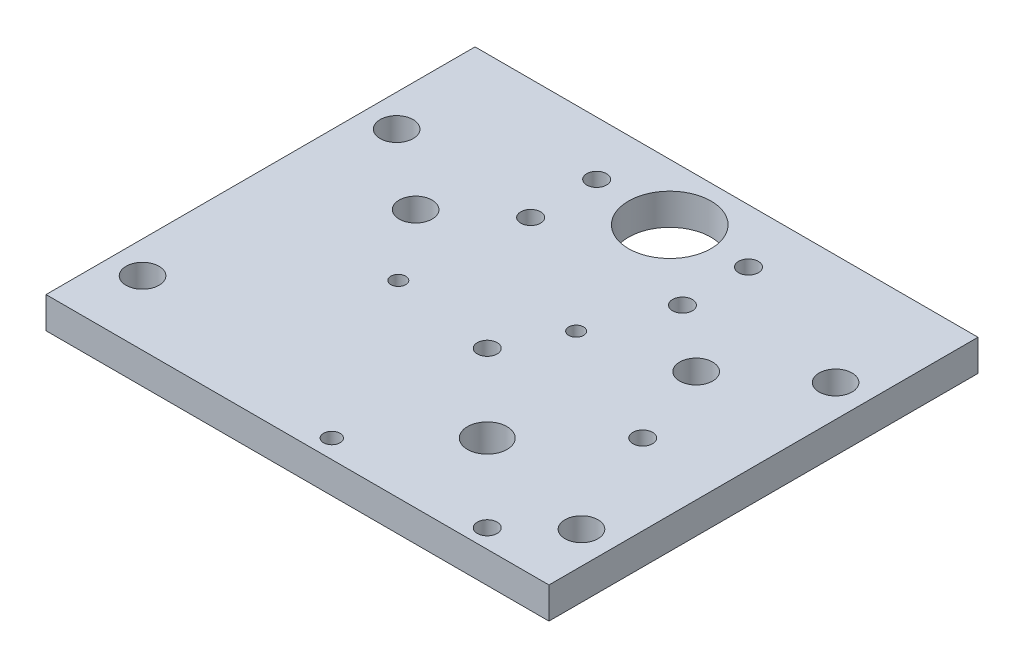
ISO-10303-21;
HEADER;
FILE_DESCRIPTION(('STEP AP214'),'2;1');
FILE_NAME('part.step','',(''),(''),'','','');
FILE_SCHEMA(('AUTOMOTIVE_DESIGN { 1 0 10303 214 1 1 1 1 }'));
ENDSEC;
DATA;
#1=APPLICATION_CONTEXT('core data for automotive mechanical design processes');
#2=APPLICATION_PROTOCOL_DEFINITION('international standard','automotive_design',2000,#1);
#3=PRODUCT_CONTEXT('',#1,'mechanical');
#4=PRODUCT('Part','Part','',(#3));
#5=PRODUCT_RELATED_PRODUCT_CATEGORY('part','',(#4));
#6=PRODUCT_DEFINITION_FORMATION('','',#4);
#7=PRODUCT_DEFINITION_CONTEXT('part definition',#1,'design');
#8=PRODUCT_DEFINITION('design','',#6,#7);
#9=PRODUCT_DEFINITION_SHAPE('','',#8);
#10=(LENGTH_UNIT() NAMED_UNIT(*) SI_UNIT(.MILLI.,.METRE.));
#11=(NAMED_UNIT(*) PLANE_ANGLE_UNIT() SI_UNIT($,.RADIAN.));
#12=(NAMED_UNIT(*) SI_UNIT($,.STERADIAN.) SOLID_ANGLE_UNIT());
#13=UNCERTAINTY_MEASURE_WITH_UNIT(LENGTH_MEASURE(1.E-05),#10,'distance_accuracy_value','');
#14=(GEOMETRIC_REPRESENTATION_CONTEXT(3) GLOBAL_UNCERTAINTY_ASSIGNED_CONTEXT((#13)) GLOBAL_UNIT_ASSIGNED_CONTEXT((#10,
#11,#12)) REPRESENTATION_CONTEXT('',''));
#15=CARTESIAN_POINT('',(0.,0.,0.));
#16=DIRECTION('',(0.,0.,1.));
#17=DIRECTION('',(1.,0.,0.));
#18=AXIS2_PLACEMENT_3D('',#15,#16,#17);
#19=CARTESIAN_POINT('',(76.2,9.5,65.));
#20=DIRECTION('',(-1.,0.,0.));
#21=DIRECTION('',(0.,0.,1.));
#22=AXIS2_PLACEMENT_3D('',#19,#20,#21);
#23=PLANE('',#22);
#24=DIRECTION('',(0.,0.,-1.));
#25=VECTOR('',#24,1.);
#26=CARTESIAN_POINT('',(76.2,0.,65.));
#27=LINE('',#26,#25);
#28=CARTESIAN_POINT('',(76.2,0.,65.));
#29=VERTEX_POINT('',#28);
#30=CARTESIAN_POINT('',(76.2,0.,-65.));
#31=VERTEX_POINT('',#30);
#32=EDGE_CURVE('E99',#29,#31,#27,.T.);
#33=ORIENTED_EDGE('',*,*,#32,.T.);
#34=DIRECTION('',(0.,-1.,0.));
#35=VECTOR('',#34,1.);
#36=CARTESIAN_POINT('',(76.2,9.5,-65.));
#37=LINE('',#36,#35);
#38=CARTESIAN_POINT('',(76.2,9.5,-65.));
#39=VERTEX_POINT('',#38);
#40=EDGE_CURVE('E11',#39,#31,#37,.T.);
#41=ORIENTED_EDGE('',*,*,#40,.F.);
#42=DIRECTION('',(0.,0.,-1.));
#43=VECTOR('',#42,1.);
#44=CARTESIAN_POINT('',(76.2,9.5,65.));
#45=LINE('',#44,#43);
#46=CARTESIAN_POINT('',(76.2,9.5,65.));
#47=VERTEX_POINT('',#46);
#48=EDGE_CURVE('E86',#47,#39,#45,.T.);
#49=ORIENTED_EDGE('',*,*,#48,.F.);
#50=DIRECTION('',(0.,-1.,0.));
#51=VECTOR('',#50,1.);
#52=CARTESIAN_POINT('',(76.2,9.5,65.));
#53=LINE('',#52,#51);
#54=EDGE_CURVE('E95',#47,#29,#53,.T.);
#55=ORIENTED_EDGE('',*,*,#54,.T.);
#56=EDGE_LOOP('',(#33,#41,#49,#55));
#57=FACE_BOUND('',#56,.T.);
#58=ADVANCED_FACE('F34',(#57),#23,.F.);
#59=CARTESIAN_POINT('',(-76.2,9.5,-65.));
#60=DIRECTION('',(0.,0.,1.));
#61=DIRECTION('',(1.,0.,0.));
#62=AXIS2_PLACEMENT_3D('',#59,#60,#61);
#63=PLANE('',#62);
#64=DIRECTION('',(-1.,0.,0.));
#65=VECTOR('',#64,1.);
#66=CARTESIAN_POINT('',(-76.2,0.,-65.));
#67=LINE('',#66,#65);
#68=CARTESIAN_POINT('',(-76.2,0.,-65.));
#69=VERTEX_POINT('',#68);
#70=EDGE_CURVE('E90',#31,#69,#67,.T.);
#71=ORIENTED_EDGE('',*,*,#70,.T.);
#72=DIRECTION('',(0.,-1.,0.));
#73=VECTOR('',#72,1.);
#74=CARTESIAN_POINT('',(-76.2,9.5,-65.));
#75=LINE('',#74,#73);
#76=CARTESIAN_POINT('',(-76.2,9.5,-65.));
#77=VERTEX_POINT('',#76);
#78=EDGE_CURVE('E43',#77,#69,#75,.T.);
#79=ORIENTED_EDGE('',*,*,#78,.F.);
#80=DIRECTION('',(-1.,0.,0.));
#81=VECTOR('',#80,1.);
#82=CARTESIAN_POINT('',(-76.2,9.5,-65.));
#83=LINE('',#82,#81);
#84=EDGE_CURVE('E81',#39,#77,#83,.T.);
#85=ORIENTED_EDGE('',*,*,#84,.F.);
#86=ORIENTED_EDGE('',*,*,#40,.T.);
#87=EDGE_LOOP('',(#71,#79,#85,#86));
#88=FACE_BOUND('',#87,.T.);
#89=ADVANCED_FACE('F89',(#88),#63,.F.);
#90=CARTESIAN_POINT('',(-76.2,9.5,65.));
#91=DIRECTION('',(1.,0.,0.));
#92=DIRECTION('',(0.,0.,-1.));
#93=AXIS2_PLACEMENT_3D('',#90,#91,#92);
#94=PLANE('',#93);
#95=DIRECTION('',(0.,0.,1.));
#96=VECTOR('',#95,1.);
#97=CARTESIAN_POINT('',(-76.2,0.,65.));
#98=LINE('',#97,#96);
#99=CARTESIAN_POINT('',(-76.2,0.,65.));
#100=VERTEX_POINT('',#99);
#101=EDGE_CURVE('E68',#69,#100,#98,.T.);
#102=ORIENTED_EDGE('',*,*,#101,.T.);
#103=DIRECTION('',(0.,-1.,0.));
#104=VECTOR('',#103,1.);
#105=CARTESIAN_POINT('',(-76.2,9.5,65.));
#106=LINE('',#105,#104);
#107=CARTESIAN_POINT('',(-76.2,9.5,65.));
#108=VERTEX_POINT('',#107);
#109=EDGE_CURVE('E91',#108,#100,#106,.T.);
#110=ORIENTED_EDGE('',*,*,#109,.F.);
#111=DIRECTION('',(0.,0.,1.));
#112=VECTOR('',#111,1.);
#113=CARTESIAN_POINT('',(-76.2,9.5,65.));
#114=LINE('',#113,#112);
#115=EDGE_CURVE('E84',#77,#108,#114,.T.);
#116=ORIENTED_EDGE('',*,*,#115,.F.);
#117=ORIENTED_EDGE('',*,*,#78,.T.);
#118=EDGE_LOOP('',(#102,#110,#116,#117));
#119=FACE_BOUND('',#118,.T.);
#120=ADVANCED_FACE('F93',(#119),#94,.F.);
#121=CARTESIAN_POINT('',(-76.2,9.5,65.));
#122=DIRECTION('',(0.,0.,-1.));
#123=DIRECTION('',(-1.,0.,0.));
#124=AXIS2_PLACEMENT_3D('',#121,#122,#123);
#125=PLANE('',#124);
#126=DIRECTION('',(1.,0.,0.));
#127=VECTOR('',#126,1.);
#128=CARTESIAN_POINT('',(-76.2,0.,65.));
#129=LINE('',#128,#127);
#130=EDGE_CURVE('E74',#100,#29,#129,.T.);
#131=ORIENTED_EDGE('',*,*,#130,.T.);
#132=ORIENTED_EDGE('',*,*,#54,.F.);
#133=DIRECTION('',(1.,0.,0.));
#134=VECTOR('',#133,1.);
#135=CARTESIAN_POINT('',(-76.2,9.5,65.));
#136=LINE('',#135,#134);
#137=EDGE_CURVE('E51',#108,#47,#136,.T.);
#138=ORIENTED_EDGE('',*,*,#137,.F.);
#139=ORIENTED_EDGE('',*,*,#109,.T.);
#140=EDGE_LOOP('',(#131,#132,#138,#139));
#141=FACE_BOUND('',#140,.T.);
#142=ADVANCED_FACE('F107',(#141),#125,.F.);
#143=CARTESIAN_POINT('',(0.,9.5,0.));
#144=DIRECTION('',(0.,-1.,0.));
#145=DIRECTION('',(0.,0.,-1.));
#146=AXIS2_PLACEMENT_3D('',#143,#144,#145);
#147=PLANE('',#146);
#148=CARTESIAN_POINT('',(-66.5,9.5,45.45));
#149=DIRECTION('',(0.,1.,0.));
#150=DIRECTION('',(0.,0.,1.));
#151=AXIS2_PLACEMENT_3D('',#148,#149,#150);
#152=CIRCLE('',#151,5.);
#153=CARTESIAN_POINT('',(-66.5,9.5,50.45));
#154=VERTEX_POINT('',#153);
#155=EDGE_CURVE('E212',#154,#154,#152,.T.);
#156=ORIENTED_EDGE('',*,*,#155,.F.);
#157=EDGE_LOOP('',(#156));
#158=FACE_BOUND('',#157,.T.);
#159=CARTESIAN_POINT('',(66.5,9.5,45.45));
#160=DIRECTION('',(0.,1.,0.));
#161=DIRECTION('',(0.,0.,-1.));
#162=AXIS2_PLACEMENT_3D('',#159,#160,#161);
#163=CIRCLE('',#162,5.);
#164=CARTESIAN_POINT('',(66.5,9.5,40.45));
#165=VERTEX_POINT('',#164);
#166=EDGE_CURVE('E206',#165,#165,#163,.T.);
#167=ORIENTED_EDGE('',*,*,#166,.F.);
#168=EDGE_LOOP('',(#167));
#169=FACE_BOUND('',#168,.T.);
#170=CARTESIAN_POINT('',(66.5,9.5,-31.55));
#171=DIRECTION('',(0.,1.,0.));
#172=DIRECTION('',(0.,0.,-1.));
#173=AXIS2_PLACEMENT_3D('',#170,#171,#172);
#174=CIRCLE('',#173,5.);
#175=CARTESIAN_POINT('',(66.5,9.5,-36.55));
#176=VERTEX_POINT('',#175);
#177=EDGE_CURVE('E200',#176,#176,#174,.T.);
#178=ORIENTED_EDGE('',*,*,#177,.F.);
#179=EDGE_LOOP('',(#178));
#180=FACE_BOUND('',#179,.T.);
#181=CARTESIAN_POINT('',(-42.5,9.5,-13.3));
#182=DIRECTION('',(0.,1.,0.));
#183=DIRECTION('',(0.,0.,1.));
#184=AXIS2_PLACEMENT_3D('',#181,#182,#183);
#185=CIRCLE('',#184,5.);
#186=CARTESIAN_POINT('',(-42.5,9.5,-8.29999999999997));
#187=VERTEX_POINT('',#186);
#188=EDGE_CURVE('E194',#187,#187,#185,.T.);
#189=ORIENTED_EDGE('',*,*,#188,.F.);
#190=EDGE_LOOP('',(#189));
#191=FACE_BOUND('',#190,.T.);
#192=CARTESIAN_POINT('',(42.5,9.5,-13.3));
#193=DIRECTION('',(0.,1.,0.));
#194=DIRECTION('',(0.,0.,1.));
#195=AXIS2_PLACEMENT_3D('',#192,#193,#194);
#196=CIRCLE('',#195,5.);
#197=CARTESIAN_POINT('',(42.5,9.5,-8.29999999999998));
#198=VERTEX_POINT('',#197);
#199=EDGE_CURVE('E188',#198,#198,#196,.T.);
#200=ORIENTED_EDGE('',*,*,#199,.F.);
#201=EDGE_LOOP('',(#200));
#202=FACE_BOUND('',#201,.T.);
#203=CARTESIAN_POINT('',(-66.5,9.5,-31.55));
#204=DIRECTION('',(0.,1.,0.));
#205=DIRECTION('',(0.,0.,1.));
#206=AXIS2_PLACEMENT_3D('',#203,#204,#205);
#207=CIRCLE('',#206,5.);
#208=CARTESIAN_POINT('',(-66.5,9.5,-26.55));
#209=VERTEX_POINT('',#208);
#210=EDGE_CURVE('E182',#209,#209,#207,.T.);
#211=ORIENTED_EDGE('',*,*,#210,.F.);
#212=EDGE_LOOP('',(#211));
#213=FACE_BOUND('',#212,.T.);
#214=CARTESIAN_POINT('',(-23.0000000000004,9.5,-28.65));
#215=DIRECTION('',(0.,1.,0.));
#216=DIRECTION('',(0.,0.,1.));
#217=AXIS2_PLACEMENT_3D('',#214,#215,#216);
#218=CIRCLE('',#217,3.);
#219=CARTESIAN_POINT('',(-23.0000000000004,9.5,-25.65));
#220=VERTEX_POINT('',#219);
#221=EDGE_CURVE('E177',#220,#220,#218,.T.);
#222=ORIENTED_EDGE('',*,*,#221,.F.);
#223=EDGE_LOOP('',(#222));
#224=FACE_BOUND('',#223,.T.);
#225=CARTESIAN_POINT('',(22.9999999999996,9.5,-48.65));
#226=DIRECTION('',(0.,1.,0.));
#227=DIRECTION('',(0.,0.,1.));
#228=AXIS2_PLACEMENT_3D('',#225,#226,#227);
#229=CIRCLE('',#228,3.);
#230=CARTESIAN_POINT('',(22.9999999999996,9.5,-45.65));
#231=VERTEX_POINT('',#230);
#232=EDGE_CURVE('E171',#231,#231,#229,.T.);
#233=ORIENTED_EDGE('',*,*,#232,.F.);
#234=EDGE_LOOP('',(#233));
#235=FACE_BOUND('',#234,.T.);
#236=CARTESIAN_POINT('',(-23.0000000000004,9.5,-48.65));
#237=DIRECTION('',(0.,1.,0.));
#238=DIRECTION('',(0.,0.,1.));
#239=AXIS2_PLACEMENT_3D('',#236,#237,#238);
#240=CIRCLE('',#239,3.);
#241=CARTESIAN_POINT('',(-23.0000000000004,9.5,-45.65));
#242=VERTEX_POINT('',#241);
#243=EDGE_CURVE('E164',#242,#242,#240,.T.);
#244=ORIENTED_EDGE('',*,*,#243,.F.);
#245=EDGE_LOOP('',(#244));
#246=FACE_BOUND('',#245,.T.);
#247=CARTESIAN_POINT('',(22.9999999999996,9.5,-28.65));
#248=DIRECTION('',(0.,1.,0.));
#249=DIRECTION('',(0.,0.,1.));
#250=AXIS2_PLACEMENT_3D('',#247,#248,#249);
#251=CIRCLE('',#250,3.);
#252=CARTESIAN_POINT('',(22.9999999999996,9.5,-25.65));
#253=VERTEX_POINT('',#252);
#254=EDGE_CURVE('E158',#253,#253,#251,.T.);
#255=ORIENTED_EDGE('',*,*,#254,.F.);
#256=EDGE_LOOP('',(#255));
#257=FACE_BOUND('',#256,.T.);
#258=CARTESIAN_POINT('',(13.7218747754838,9.5,-5.70534294419384));
#259=DIRECTION('',(0.,1.,0.));
#260=DIRECTION('',(0.,0.,1.));
#261=AXIS2_PLACEMENT_3D('',#258,#259,#260);
#262=CIRCLE('',#261,2.25);
#263=CARTESIAN_POINT('',(13.7218747754838,9.5,-3.45534294419384));
#264=VERTEX_POINT('',#263);
#265=EDGE_CURVE('E153',#264,#264,#262,.T.);
#266=ORIENTED_EDGE('',*,*,#265,.F.);
#267=EDGE_LOOP('',(#266));
#268=FACE_BOUND('',#267,.T.);
#269=CARTESIAN_POINT('',(-3.88578059473399E-13,9.5,-47.8));
#270=DIRECTION('',(0.,1.,0.));
#271=DIRECTION('',(0.,0.,1.));
#272=AXIS2_PLACEMENT_3D('',#269,#270,#271);
#273=CIRCLE('',#272,12.5);
#274=CARTESIAN_POINT('',(-3.88578059473399E-13,9.5,-35.3));
#275=VERTEX_POINT('',#274);
#276=EDGE_CURVE('E146',#275,#275,#273,.T.);
#277=ORIENTED_EDGE('',*,*,#276,.F.);
#278=EDGE_LOOP('',(#277));
#279=FACE_BOUND('',#278,.T.);
#280=CARTESIAN_POINT('',(-26.5341289816574,9.5,7.92198847120222));
#281=DIRECTION('',(0.,1.,0.));
#282=DIRECTION('',(0.,0.,1.));
#283=AXIS2_PLACEMENT_3D('',#280,#281,#282);
#284=CIRCLE('',#283,2.25);
#285=CARTESIAN_POINT('',(-26.5341289816574,9.5,10.1719884712022));
#286=VERTEX_POINT('',#285);
#287=EDGE_CURVE('E140',#286,#286,#284,.T.);
#288=ORIENTED_EDGE('',*,*,#287,.F.);
#289=EDGE_LOOP('',(#288));
#290=FACE_BOUND('',#289,.T.);
#291=CARTESIAN_POINT('',(28.3,9.5,35.8));
#292=DIRECTION('',(0.,1.,0.));
#293=DIRECTION('',(0.,0.,1.));
#294=AXIS2_PLACEMENT_3D('',#291,#292,#293);
#295=CIRCLE('',#294,6.);
#296=CARTESIAN_POINT('',(28.3,9.5,41.8));
#297=VERTEX_POINT('',#296);
#298=EDGE_CURVE('E136',#297,#297,#295,.T.);
#299=ORIENTED_EDGE('',*,*,#298,.F.);
#300=EDGE_LOOP('',(#299));
#301=FACE_BOUND('',#300,.T.);
#302=CARTESIAN_POINT('',(51.85,9.5,59.35));
#303=DIRECTION('',(0.,-1.,0.));
#304=DIRECTION('',(0.,0.,-1.));
#305=AXIS2_PLACEMENT_3D('',#302,#303,#304);
#306=CIRCLE('',#305,3.);
#307=CARTESIAN_POINT('',(51.85,9.5,56.35));
#308=VERTEX_POINT('',#307);
#309=EDGE_CURVE('E118',#308,#308,#306,.T.);
#310=ORIENTED_EDGE('',*,*,#309,.T.);
#311=EDGE_LOOP('',(#310));
#312=FACE_BOUND('',#311,.T.);
#313=CARTESIAN_POINT('',(4.75000000000001,9.5,12.25));
#314=DIRECTION('',(0.,-1.,0.));
#315=DIRECTION('',(0.,0.,-1.));
#316=AXIS2_PLACEMENT_3D('',#313,#314,#315);
#317=CIRCLE('',#316,3.);
#318=CARTESIAN_POINT('',(4.75000000000001,9.5,9.25000000000002));
#319=VERTEX_POINT('',#318);
#320=EDGE_CURVE('E121',#319,#319,#317,.T.);
#321=ORIENTED_EDGE('',*,*,#320,.T.);
#322=EDGE_LOOP('',(#321));
#323=FACE_BOUND('',#322,.T.);
#324=CARTESIAN_POINT('',(51.85,9.5,12.25));
#325=DIRECTION('',(0.,-1.,0.));
#326=DIRECTION('',(0.,0.,-1.));
#327=AXIS2_PLACEMENT_3D('',#324,#325,#326);
#328=CIRCLE('',#327,3.);
#329=CARTESIAN_POINT('',(51.85,9.5,9.25000000000002));
#330=VERTEX_POINT('',#329);
#331=EDGE_CURVE('E124',#330,#330,#328,.T.);
#332=ORIENTED_EDGE('',*,*,#331,.T.);
#333=EDGE_LOOP('',(#332));
#334=FACE_BOUND('',#333,.T.);
#335=CARTESIAN_POINT('',(4.75000000000001,9.5,59.35));
#336=DIRECTION('',(0.,-1.,0.));
#337=DIRECTION('',(0.,0.,-1.));
#338=AXIS2_PLACEMENT_3D('',#335,#336,#337);
#339=CIRCLE('',#338,2.5);
#340=CARTESIAN_POINT('',(4.75000000000001,9.5,56.85));
#341=VERTEX_POINT('',#340);
#342=EDGE_CURVE('E102',#341,#341,#339,.T.);
#343=ORIENTED_EDGE('',*,*,#342,.T.);
#344=EDGE_LOOP('',(#343));
#345=FACE_BOUND('',#344,.T.);
#346=ORIENTED_EDGE('',*,*,#48,.T.);
#347=ORIENTED_EDGE('',*,*,#84,.T.);
#348=ORIENTED_EDGE('',*,*,#115,.T.);
#349=ORIENTED_EDGE('',*,*,#137,.T.);
#350=EDGE_LOOP('',(#346,#347,#348,#349));
#351=FACE_BOUND('',#350,.T.);
#352=ADVANCED_FACE('F82',(#158,#169,#180,#191,#202,#213,#224,#235,#246,#257,#268,#279,#290,#301,
#312,#323,#334,#345,#351),#147,.F.);
#353=CARTESIAN_POINT('',(0.,0.,0.));
#354=DIRECTION('',(0.,-1.,0.));
#355=DIRECTION('',(0.,0.,-1.));
#356=AXIS2_PLACEMENT_3D('',#353,#354,#355);
#357=PLANE('',#356);
#358=CARTESIAN_POINT('',(-66.5,0.,45.45));
#359=DIRECTION('',(0.,1.,0.));
#360=DIRECTION('',(0.,0.,1.));
#361=AXIS2_PLACEMENT_3D('',#358,#359,#360);
#362=CIRCLE('',#361,5.);
#363=CARTESIAN_POINT('',(-66.5,0.,50.45));
#364=VERTEX_POINT('',#363);
#365=EDGE_CURVE('E185',#364,#364,#362,.T.);
#366=ORIENTED_EDGE('',*,*,#365,.T.);
#367=EDGE_LOOP('',(#366));
#368=FACE_BOUND('',#367,.T.);
#369=CARTESIAN_POINT('',(66.5,0.,45.45));
#370=DIRECTION('',(0.,1.,0.));
#371=DIRECTION('',(0.,0.,-1.));
#372=AXIS2_PLACEMENT_3D('',#369,#370,#371);
#373=CIRCLE('',#372,5.);
#374=CARTESIAN_POINT('',(66.5,0.,40.45));
#375=VERTEX_POINT('',#374);
#376=EDGE_CURVE('E209',#375,#375,#373,.T.);
#377=ORIENTED_EDGE('',*,*,#376,.T.);
#378=EDGE_LOOP('',(#377));
#379=FACE_BOUND('',#378,.T.);
#380=CARTESIAN_POINT('',(66.5,0.,-31.55));
#381=DIRECTION('',(0.,1.,0.));
#382=DIRECTION('',(0.,0.,-1.));
#383=AXIS2_PLACEMENT_3D('',#380,#381,#382);
#384=CIRCLE('',#383,5.);
#385=CARTESIAN_POINT('',(66.5,0.,-36.55));
#386=VERTEX_POINT('',#385);
#387=EDGE_CURVE('E203',#386,#386,#384,.T.);
#388=ORIENTED_EDGE('',*,*,#387,.T.);
#389=EDGE_LOOP('',(#388));
#390=FACE_BOUND('',#389,.T.);
#391=CARTESIAN_POINT('',(-42.5,0.,-13.3));
#392=DIRECTION('',(0.,1.,0.));
#393=DIRECTION('',(0.,0.,1.));
#394=AXIS2_PLACEMENT_3D('',#391,#392,#393);
#395=CIRCLE('',#394,5.);
#396=CARTESIAN_POINT('',(-42.5,0.,-8.29999999999997));
#397=VERTEX_POINT('',#396);
#398=EDGE_CURVE('E197',#397,#397,#395,.T.);
#399=ORIENTED_EDGE('',*,*,#398,.T.);
#400=EDGE_LOOP('',(#399));
#401=FACE_BOUND('',#400,.T.);
#402=CARTESIAN_POINT('',(42.5,0.,-13.3));
#403=DIRECTION('',(0.,1.,0.));
#404=DIRECTION('',(0.,0.,1.));
#405=AXIS2_PLACEMENT_3D('',#402,#403,#404);
#406=CIRCLE('',#405,5.);
#407=CARTESIAN_POINT('',(42.5,0.,-8.29999999999998));
#408=VERTEX_POINT('',#407);
#409=EDGE_CURVE('E191',#408,#408,#406,.T.);
#410=ORIENTED_EDGE('',*,*,#409,.T.);
#411=EDGE_LOOP('',(#410));
#412=FACE_BOUND('',#411,.T.);
#413=CARTESIAN_POINT('',(-66.5,0.,-31.55));
#414=DIRECTION('',(0.,1.,0.));
#415=DIRECTION('',(0.,0.,1.));
#416=AXIS2_PLACEMENT_3D('',#413,#414,#415);
#417=CIRCLE('',#416,5.);
#418=CARTESIAN_POINT('',(-66.5,0.,-26.55));
#419=VERTEX_POINT('',#418);
#420=EDGE_CURVE('E168',#419,#419,#417,.T.);
#421=ORIENTED_EDGE('',*,*,#420,.T.);
#422=EDGE_LOOP('',(#421));
#423=FACE_BOUND('',#422,.T.);
#424=CARTESIAN_POINT('',(-23.0000000000004,0.,-28.65));
#425=DIRECTION('',(0.,1.,0.));
#426=DIRECTION('',(0.,0.,1.));
#427=AXIS2_PLACEMENT_3D('',#424,#425,#426);
#428=CIRCLE('',#427,3.);
#429=CARTESIAN_POINT('',(-23.0000000000004,0.,-25.65));
#430=VERTEX_POINT('',#429);
#431=EDGE_CURVE('E161',#430,#430,#428,.T.);
#432=ORIENTED_EDGE('',*,*,#431,.T.);
#433=EDGE_LOOP('',(#432));
#434=FACE_BOUND('',#433,.T.);
#435=CARTESIAN_POINT('',(22.9999999999996,0.,-48.65));
#436=DIRECTION('',(0.,1.,0.));
#437=DIRECTION('',(0.,0.,1.));
#438=AXIS2_PLACEMENT_3D('',#435,#436,#437);
#439=CIRCLE('',#438,3.);
#440=CARTESIAN_POINT('',(22.9999999999996,0.,-45.65));
#441=VERTEX_POINT('',#440);
#442=EDGE_CURVE('E174',#441,#441,#439,.T.);
#443=ORIENTED_EDGE('',*,*,#442,.T.);
#444=EDGE_LOOP('',(#443));
#445=FACE_BOUND('',#444,.T.);
#446=CARTESIAN_POINT('',(-23.0000000000004,0.,-48.65));
#447=DIRECTION('',(0.,1.,0.));
#448=DIRECTION('',(0.,0.,1.));
#449=AXIS2_PLACEMENT_3D('',#446,#447,#448);
#450=CIRCLE('',#449,3.);
#451=CARTESIAN_POINT('',(-23.0000000000004,0.,-45.65));
#452=VERTEX_POINT('',#451);
#453=EDGE_CURVE('E167',#452,#452,#450,.T.);
#454=ORIENTED_EDGE('',*,*,#453,.T.);
#455=EDGE_LOOP('',(#454));
#456=FACE_BOUND('',#455,.T.);
#457=CARTESIAN_POINT('',(22.9999999999996,0.,-28.65));
#458=DIRECTION('',(0.,1.,0.));
#459=DIRECTION('',(0.,0.,1.));
#460=AXIS2_PLACEMENT_3D('',#457,#458,#459);
#461=CIRCLE('',#460,3.);
#462=CARTESIAN_POINT('',(22.9999999999996,0.,-25.65));
#463=VERTEX_POINT('',#462);
#464=EDGE_CURVE('E150',#463,#463,#461,.T.);
#465=ORIENTED_EDGE('',*,*,#464,.T.);
#466=EDGE_LOOP('',(#465));
#467=FACE_BOUND('',#466,.T.);
#468=CARTESIAN_POINT('',(13.7218747754838,0.,-5.70534294419384));
#469=DIRECTION('',(0.,1.,0.));
#470=DIRECTION('',(0.,0.,1.));
#471=AXIS2_PLACEMENT_3D('',#468,#469,#470);
#472=CIRCLE('',#471,2.25);
#473=CARTESIAN_POINT('',(13.7218747754838,0.,-3.45534294419384));
#474=VERTEX_POINT('',#473);
#475=EDGE_CURVE('E143',#474,#474,#472,.T.);
#476=ORIENTED_EDGE('',*,*,#475,.T.);
#477=EDGE_LOOP('',(#476));
#478=FACE_BOUND('',#477,.T.);
#479=CARTESIAN_POINT('',(-3.88578059473399E-13,0.,-47.8));
#480=DIRECTION('',(0.,1.,0.));
#481=DIRECTION('',(0.,0.,1.));
#482=AXIS2_PLACEMENT_3D('',#479,#480,#481);
#483=CIRCLE('',#482,12.5);
#484=CARTESIAN_POINT('',(-3.88578059473399E-13,0.,-35.3));
#485=VERTEX_POINT('',#484);
#486=EDGE_CURVE('E149',#485,#485,#483,.T.);
#487=ORIENTED_EDGE('',*,*,#486,.T.);
#488=EDGE_LOOP('',(#487));
#489=FACE_BOUND('',#488,.T.);
#490=CARTESIAN_POINT('',(-26.5341289816574,0.,7.92198847120222));
#491=DIRECTION('',(0.,1.,0.));
#492=DIRECTION('',(0.,0.,1.));
#493=AXIS2_PLACEMENT_3D('',#490,#491,#492);
#494=CIRCLE('',#493,2.25);
#495=CARTESIAN_POINT('',(-26.5341289816574,0.,10.1719884712022));
#496=VERTEX_POINT('',#495);
#497=EDGE_CURVE('E139',#496,#496,#494,.T.);
#498=ORIENTED_EDGE('',*,*,#497,.T.);
#499=EDGE_LOOP('',(#498));
#500=FACE_BOUND('',#499,.T.);
#501=CARTESIAN_POINT('',(28.3,0.,35.8));
#502=DIRECTION('',(0.,-1.,0.));
#503=DIRECTION('',(0.,0.,-1.));
#504=AXIS2_PLACEMENT_3D('',#501,#502,#503);
#505=CIRCLE('',#504,6.);
#506=CARTESIAN_POINT('',(28.3,0.,29.8));
#507=VERTEX_POINT('',#506);
#508=EDGE_CURVE('E37',#507,#507,#505,.T.);
#509=ORIENTED_EDGE('',*,*,#508,.F.);
#510=EDGE_LOOP('',(#509));
#511=FACE_BOUND('',#510,.T.);
#512=CARTESIAN_POINT('',(51.85,0.,59.35));
#513=DIRECTION('',(0.,-1.,0.));
#514=DIRECTION('',(0.,0.,-1.));
#515=AXIS2_PLACEMENT_3D('',#512,#513,#514);
#516=CIRCLE('',#515,3.);
#517=CARTESIAN_POINT('',(51.85,0.,56.35));
#518=VERTEX_POINT('',#517);
#519=EDGE_CURVE('E127',#518,#518,#516,.T.);
#520=ORIENTED_EDGE('',*,*,#519,.F.);
#521=EDGE_LOOP('',(#520));
#522=FACE_BOUND('',#521,.T.);
#523=CARTESIAN_POINT('',(4.75000000000001,0.,12.25));
#524=DIRECTION('',(0.,-1.,0.));
#525=DIRECTION('',(0.,0.,-1.));
#526=AXIS2_PLACEMENT_3D('',#523,#524,#525);
#527=CIRCLE('',#526,3.);
#528=CARTESIAN_POINT('',(4.75000000000001,0.,9.25000000000002));
#529=VERTEX_POINT('',#528);
#530=EDGE_CURVE('E131',#529,#529,#527,.T.);
#531=ORIENTED_EDGE('',*,*,#530,.F.);
#532=EDGE_LOOP('',(#531));
#533=FACE_BOUND('',#532,.T.);
#534=CARTESIAN_POINT('',(51.85,0.,12.25));
#535=DIRECTION('',(0.,-1.,0.));
#536=DIRECTION('',(0.,0.,-1.));
#537=AXIS2_PLACEMENT_3D('',#534,#535,#536);
#538=CIRCLE('',#537,3.);
#539=CARTESIAN_POINT('',(51.85,0.,9.25000000000002));
#540=VERTEX_POINT('',#539);
#541=EDGE_CURVE('E128',#540,#540,#538,.T.);
#542=ORIENTED_EDGE('',*,*,#541,.F.);
#543=EDGE_LOOP('',(#542));
#544=FACE_BOUND('',#543,.T.);
#545=CARTESIAN_POINT('',(4.75000000000001,0.,59.35));
#546=DIRECTION('',(0.,-1.,0.));
#547=DIRECTION('',(0.,0.,-1.));
#548=AXIS2_PLACEMENT_3D('',#545,#546,#547);
#549=CIRCLE('',#548,2.5);
#550=CARTESIAN_POINT('',(4.75000000000001,0.,56.85));
#551=VERTEX_POINT('',#550);
#552=EDGE_CURVE('E115',#551,#551,#549,.T.);
#553=ORIENTED_EDGE('',*,*,#552,.F.);
#554=EDGE_LOOP('',(#553));
#555=FACE_BOUND('',#554,.T.);
#556=ORIENTED_EDGE('',*,*,#32,.F.);
#557=ORIENTED_EDGE('',*,*,#130,.F.);
#558=ORIENTED_EDGE('',*,*,#101,.F.);
#559=ORIENTED_EDGE('',*,*,#70,.F.);
#560=EDGE_LOOP('',(#556,#557,#558,#559));
#561=FACE_BOUND('',#560,.T.);
#562=ADVANCED_FACE('F110',(#368,#379,#390,#401,#412,#423,#434,#445,#456,#467,#478,#489,#500,
#511,#522,#533,#544,#555,#561),#357,.T.);
#563=CARTESIAN_POINT('',(4.75000000000001,10.,59.35));
#564=DIRECTION('',(0.,-1.,0.));
#565=DIRECTION('',(0.,0.,-1.));
#566=AXIS2_PLACEMENT_3D('',#563,#564,#565);
#567=CYLINDRICAL_SURFACE('',#566,2.5);
#568=ORIENTED_EDGE('',*,*,#552,.T.);
#569=EDGE_LOOP('',(#568));
#570=FACE_BOUND('',#569,.T.);
#571=ORIENTED_EDGE('',*,*,#342,.F.);
#572=EDGE_LOOP('',(#571));
#573=FACE_BOUND('',#572,.T.);
#574=ADVANCED_FACE('F264',(#570,#573),#567,.F.);
#575=CARTESIAN_POINT('',(51.85,10.,12.25));
#576=DIRECTION('',(0.,-1.,0.));
#577=DIRECTION('',(0.,0.,-1.));
#578=AXIS2_PLACEMENT_3D('',#575,#576,#577);
#579=CYLINDRICAL_SURFACE('',#578,3.);
#580=ORIENTED_EDGE('',*,*,#541,.T.);
#581=EDGE_LOOP('',(#580));
#582=FACE_BOUND('',#581,.T.);
#583=ORIENTED_EDGE('',*,*,#331,.F.);
#584=EDGE_LOOP('',(#583));
#585=FACE_BOUND('',#584,.T.);
#586=ADVANCED_FACE('F266',(#582,#585),#579,.F.);
#587=CARTESIAN_POINT('',(4.75000000000001,10.,12.25));
#588=DIRECTION('',(0.,-1.,0.));
#589=DIRECTION('',(0.,0.,-1.));
#590=AXIS2_PLACEMENT_3D('',#587,#588,#589);
#591=CYLINDRICAL_SURFACE('',#590,3.);
#592=ORIENTED_EDGE('',*,*,#530,.T.);
#593=EDGE_LOOP('',(#592));
#594=FACE_BOUND('',#593,.T.);
#595=ORIENTED_EDGE('',*,*,#320,.F.);
#596=EDGE_LOOP('',(#595));
#597=FACE_BOUND('',#596,.T.);
#598=ADVANCED_FACE('F273',(#594,#597),#591,.F.);
#599=CARTESIAN_POINT('',(51.85,10.,59.35));
#600=DIRECTION('',(0.,-1.,0.));
#601=DIRECTION('',(0.,0.,-1.));
#602=AXIS2_PLACEMENT_3D('',#599,#600,#601);
#603=CYLINDRICAL_SURFACE('',#602,3.);
#604=ORIENTED_EDGE('',*,*,#519,.T.);
#605=EDGE_LOOP('',(#604));
#606=FACE_BOUND('',#605,.T.);
#607=ORIENTED_EDGE('',*,*,#309,.F.);
#608=EDGE_LOOP('',(#607));
#609=FACE_BOUND('',#608,.T.);
#610=ADVANCED_FACE('F395',(#606,#609),#603,.F.);
#611=CARTESIAN_POINT('',(28.3,-0.5,35.8));
#612=DIRECTION('',(0.,1.,0.));
#613=DIRECTION('',(0.,0.,1.));
#614=AXIS2_PLACEMENT_3D('',#611,#612,#613);
#615=CYLINDRICAL_SURFACE('',#614,6.);
#616=ORIENTED_EDGE('',*,*,#508,.T.);
#617=EDGE_LOOP('',(#616));
#618=FACE_BOUND('',#617,.T.);
#619=ORIENTED_EDGE('',*,*,#298,.T.);
#620=EDGE_LOOP('',(#619));
#621=FACE_BOUND('',#620,.T.);
#622=ADVANCED_FACE('F391',(#618,#621),#615,.F.);
#623=CARTESIAN_POINT('',(-26.5341289816574,0.,7.92198847120222));
#624=DIRECTION('',(0.,1.,0.));
#625=DIRECTION('',(0.,0.,1.));
#626=AXIS2_PLACEMENT_3D('',#623,#624,#625);
#627=CYLINDRICAL_SURFACE('',#626,2.25);
#628=ORIENTED_EDGE('',*,*,#497,.F.);
#629=EDGE_LOOP('',(#628));
#630=FACE_BOUND('',#629,.T.);
#631=ORIENTED_EDGE('',*,*,#287,.T.);
#632=EDGE_LOOP('',(#631));
#633=FACE_BOUND('',#632,.T.);
#634=ADVANCED_FACE('F387',(#630,#633),#627,.F.);
#635=CARTESIAN_POINT('',(-3.88578059473399E-13,0.,-47.8));
#636=DIRECTION('',(0.,1.,0.));
#637=DIRECTION('',(0.,0.,1.));
#638=AXIS2_PLACEMENT_3D('',#635,#636,#637);
#639=CYLINDRICAL_SURFACE('',#638,12.5);
#640=ORIENTED_EDGE('',*,*,#486,.F.);
#641=EDGE_LOOP('',(#640));
#642=FACE_BOUND('',#641,.T.);
#643=ORIENTED_EDGE('',*,*,#276,.T.);
#644=EDGE_LOOP('',(#643));
#645=FACE_BOUND('',#644,.T.);
#646=ADVANCED_FACE('F383',(#642,#645),#639,.F.);
#647=CARTESIAN_POINT('',(13.7218747754838,0.,-5.70534294419384));
#648=DIRECTION('',(0.,1.,0.));
#649=DIRECTION('',(0.,0.,1.));
#650=AXIS2_PLACEMENT_3D('',#647,#648,#649);
#651=CYLINDRICAL_SURFACE('',#650,2.25);
#652=ORIENTED_EDGE('',*,*,#475,.F.);
#653=EDGE_LOOP('',(#652));
#654=FACE_BOUND('',#653,.T.);
#655=ORIENTED_EDGE('',*,*,#265,.T.);
#656=EDGE_LOOP('',(#655));
#657=FACE_BOUND('',#656,.T.);
#658=ADVANCED_FACE('F379',(#654,#657),#651,.F.);
#659=CARTESIAN_POINT('',(22.9999999999996,0.,-28.65));
#660=DIRECTION('',(0.,1.,0.));
#661=DIRECTION('',(0.,0.,1.));
#662=AXIS2_PLACEMENT_3D('',#659,#660,#661);
#663=CYLINDRICAL_SURFACE('',#662,3.);
#664=ORIENTED_EDGE('',*,*,#464,.F.);
#665=EDGE_LOOP('',(#664));
#666=FACE_BOUND('',#665,.T.);
#667=ORIENTED_EDGE('',*,*,#254,.T.);
#668=EDGE_LOOP('',(#667));
#669=FACE_BOUND('',#668,.T.);
#670=ADVANCED_FACE('F375',(#666,#669),#663,.F.);
#671=CARTESIAN_POINT('',(-23.0000000000004,0.,-48.65));
#672=DIRECTION('',(0.,1.,0.));
#673=DIRECTION('',(0.,0.,1.));
#674=AXIS2_PLACEMENT_3D('',#671,#672,#673);
#675=CYLINDRICAL_SURFACE('',#674,3.);
#676=ORIENTED_EDGE('',*,*,#453,.F.);
#677=EDGE_LOOP('',(#676));
#678=FACE_BOUND('',#677,.T.);
#679=ORIENTED_EDGE('',*,*,#243,.T.);
#680=EDGE_LOOP('',(#679));
#681=FACE_BOUND('',#680,.T.);
#682=ADVANCED_FACE('F371',(#678,#681),#675,.F.);
#683=CARTESIAN_POINT('',(22.9999999999996,0.,-48.65));
#684=DIRECTION('',(0.,1.,0.));
#685=DIRECTION('',(0.,0.,1.));
#686=AXIS2_PLACEMENT_3D('',#683,#684,#685);
#687=CYLINDRICAL_SURFACE('',#686,3.);
#688=ORIENTED_EDGE('',*,*,#442,.F.);
#689=EDGE_LOOP('',(#688));
#690=FACE_BOUND('',#689,.T.);
#691=ORIENTED_EDGE('',*,*,#232,.T.);
#692=EDGE_LOOP('',(#691));
#693=FACE_BOUND('',#692,.T.);
#694=ADVANCED_FACE('F367',(#690,#693),#687,.F.);
#695=CARTESIAN_POINT('',(-23.0000000000004,0.,-28.65));
#696=DIRECTION('',(0.,1.,0.));
#697=DIRECTION('',(0.,0.,1.));
#698=AXIS2_PLACEMENT_3D('',#695,#696,#697);
#699=CYLINDRICAL_SURFACE('',#698,3.);
#700=ORIENTED_EDGE('',*,*,#431,.F.);
#701=EDGE_LOOP('',(#700));
#702=FACE_BOUND('',#701,.T.);
#703=ORIENTED_EDGE('',*,*,#221,.T.);
#704=EDGE_LOOP('',(#703));
#705=FACE_BOUND('',#704,.T.);
#706=ADVANCED_FACE('F312',(#702,#705),#699,.F.);
#707=CARTESIAN_POINT('',(-66.5,0.,-31.55));
#708=DIRECTION('',(0.,1.,0.));
#709=DIRECTION('',(0.,0.,1.));
#710=AXIS2_PLACEMENT_3D('',#707,#708,#709);
#711=CYLINDRICAL_SURFACE('',#710,5.);
#712=ORIENTED_EDGE('',*,*,#420,.F.);
#713=EDGE_LOOP('',(#712));
#714=FACE_BOUND('',#713,.T.);
#715=ORIENTED_EDGE('',*,*,#210,.T.);
#716=EDGE_LOOP('',(#715));
#717=FACE_BOUND('',#716,.T.);
#718=ADVANCED_FACE('F306',(#714,#717),#711,.F.);
#719=CARTESIAN_POINT('',(42.5,0.,-13.3));
#720=DIRECTION('',(0.,1.,0.));
#721=DIRECTION('',(0.,0.,1.));
#722=AXIS2_PLACEMENT_3D('',#719,#720,#721);
#723=CYLINDRICAL_SURFACE('',#722,5.);
#724=ORIENTED_EDGE('',*,*,#409,.F.);
#725=EDGE_LOOP('',(#724));
#726=FACE_BOUND('',#725,.T.);
#727=ORIENTED_EDGE('',*,*,#199,.T.);
#728=EDGE_LOOP('',(#727));
#729=FACE_BOUND('',#728,.T.);
#730=ADVANCED_FACE('F311',(#726,#729),#723,.F.);
#731=CARTESIAN_POINT('',(-42.5,0.,-13.3));
#732=DIRECTION('',(0.,1.,0.));
#733=DIRECTION('',(0.,0.,1.));
#734=AXIS2_PLACEMENT_3D('',#731,#732,#733);
#735=CYLINDRICAL_SURFACE('',#734,5.);
#736=ORIENTED_EDGE('',*,*,#398,.F.);
#737=EDGE_LOOP('',(#736));
#738=FACE_BOUND('',#737,.T.);
#739=ORIENTED_EDGE('',*,*,#188,.T.);
#740=EDGE_LOOP('',(#739));
#741=FACE_BOUND('',#740,.T.);
#742=ADVANCED_FACE('F324',(#738,#741),#735,.F.);
#743=CARTESIAN_POINT('',(66.5,0.,-31.55));
#744=DIRECTION('',(0.,1.,0.));
#745=DIRECTION('',(0.,0.,1.));
#746=AXIS2_PLACEMENT_3D('',#743,#744,#745);
#747=CYLINDRICAL_SURFACE('',#746,5.);
#748=ORIENTED_EDGE('',*,*,#387,.F.);
#749=EDGE_LOOP('',(#748));
#750=FACE_BOUND('',#749,.T.);
#751=ORIENTED_EDGE('',*,*,#177,.T.);
#752=EDGE_LOOP('',(#751));
#753=FACE_BOUND('',#752,.T.);
#754=ADVANCED_FACE('F334',(#750,#753),#747,.F.);
#755=CARTESIAN_POINT('',(66.5,0.,45.45));
#756=DIRECTION('',(0.,1.,0.));
#757=DIRECTION('',(0.,0.,1.));
#758=AXIS2_PLACEMENT_3D('',#755,#756,#757);
#759=CYLINDRICAL_SURFACE('',#758,5.);
#760=ORIENTED_EDGE('',*,*,#376,.F.);
#761=EDGE_LOOP('',(#760));
#762=FACE_BOUND('',#761,.T.);
#763=ORIENTED_EDGE('',*,*,#166,.T.);
#764=EDGE_LOOP('',(#763));
#765=FACE_BOUND('',#764,.T.);
#766=ADVANCED_FACE('F223',(#762,#765),#759,.F.);
#767=CARTESIAN_POINT('',(-66.5,0.,45.45));
#768=DIRECTION('',(0.,1.,0.));
#769=DIRECTION('',(0.,0.,1.));
#770=AXIS2_PLACEMENT_3D('',#767,#768,#769);
#771=CYLINDRICAL_SURFACE('',#770,5.);
#772=ORIENTED_EDGE('',*,*,#365,.F.);
#773=EDGE_LOOP('',(#772));
#774=FACE_BOUND('',#773,.T.);
#775=ORIENTED_EDGE('',*,*,#155,.T.);
#776=EDGE_LOOP('',(#775));
#777=FACE_BOUND('',#776,.T.);
#778=ADVANCED_FACE('F220',(#774,#777),#771,.F.);
#779=CLOSED_SHELL('',(#58,#89,#120,#142,#352,#562,#574,#586,#598,#610,#622,#634,#646,#658,#670,
#682,#694,#706,#718,#730,#742,#754,#766,#778));
#780=MANIFOLD_SOLID_BREP('B2',#779);
#781=ADVANCED_BREP_SHAPE_REPRESENTATION('',(#18,#780),#14);
#782=SHAPE_DEFINITION_REPRESENTATION(#9,#781);
ENDSEC;
END-ISO-10303-21;
